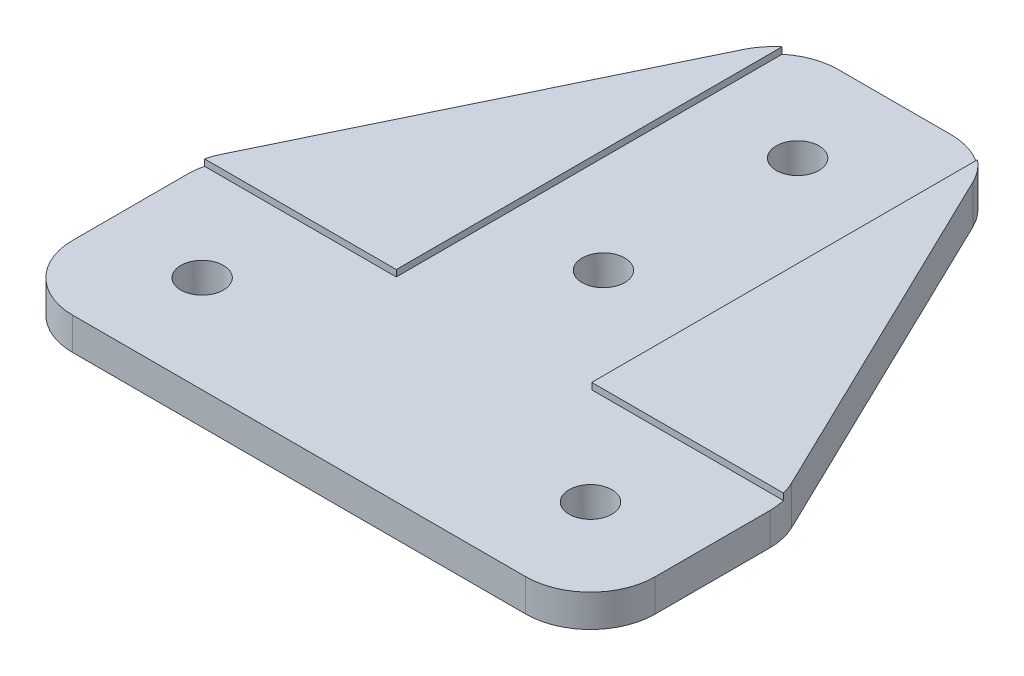
ISO-10303-21;
HEADER;
FILE_DESCRIPTION(('STEP AP214'),'2;1');
FILE_NAME('part.step','',(''),(''),'','','');
FILE_SCHEMA(('AUTOMOTIVE_DESIGN { 1 0 10303 214 1 1 1 1 }'));
ENDSEC;
DATA;
#1=APPLICATION_CONTEXT('core data for automotive mechanical design processes');
#2=APPLICATION_PROTOCOL_DEFINITION('international standard','automotive_design',2000,#1);
#3=PRODUCT_CONTEXT('',#1,'mechanical');
#4=PRODUCT('Part','Part','',(#3));
#5=PRODUCT_RELATED_PRODUCT_CATEGORY('part','',(#4));
#6=PRODUCT_DEFINITION_FORMATION('','',#4);
#7=PRODUCT_DEFINITION_CONTEXT('part definition',#1,'design');
#8=PRODUCT_DEFINITION('design','',#6,#7);
#9=PRODUCT_DEFINITION_SHAPE('','',#8);
#10=(LENGTH_UNIT() NAMED_UNIT(*) SI_UNIT(.MILLI.,.METRE.));
#11=(NAMED_UNIT(*) PLANE_ANGLE_UNIT() SI_UNIT($,.RADIAN.));
#12=(NAMED_UNIT(*) SI_UNIT($,.STERADIAN.) SOLID_ANGLE_UNIT());
#13=UNCERTAINTY_MEASURE_WITH_UNIT(LENGTH_MEASURE(1.E-05),#10,'distance_accuracy_value','');
#14=(GEOMETRIC_REPRESENTATION_CONTEXT(3) GLOBAL_UNCERTAINTY_ASSIGNED_CONTEXT((#13)) GLOBAL_UNIT_ASSIGNED_CONTEXT((#10,
#11,#12)) REPRESENTATION_CONTEXT('',''));
#15=CARTESIAN_POINT('',(0.,0.,0.));
#16=DIRECTION('',(0.,0.,1.));
#17=DIRECTION('',(1.,0.,0.));
#18=AXIS2_PLACEMENT_3D('',#15,#16,#17);
#19=CARTESIAN_POINT('',(0.,3.,0.));
#20=DIRECTION('',(0.,1.,0.));
#21=DIRECTION('',(0.,0.,1.));
#22=AXIS2_PLACEMENT_3D('',#19,#20,#21);
#23=PLANE('',#22);
#24=DIRECTION('',(-1.,0.,0.));
#25=VECTOR('',#24,1.);
#26=CARTESIAN_POINT('',(0.,3.,-15.05));
#27=LINE('',#26,#25);
#28=CARTESIAN_POINT('',(14.95,3.,-15.05));
#29=VERTEX_POINT('',#28);
#30=CARTESIAN_POINT('',(0.145177207228024,3.,-15.05));
#31=VERTEX_POINT('',#30);
#32=EDGE_CURVE('E221',#29,#31,#27,.T.);
#33=ORIENTED_EDGE('',*,*,#32,.F.);
#34=DIRECTION('',(0.,0.,1.));
#35=VECTOR('',#34,1.);
#36=CARTESIAN_POINT('',(14.95,3.,-46.));
#37=LINE('',#36,#35);
#38=CARTESIAN_POINT('',(14.95,3.,-44.8541389701653));
#39=VERTEX_POINT('',#38);
#40=EDGE_CURVE('E218',#39,#29,#37,.T.);
#41=ORIENTED_EDGE('',*,*,#40,.F.);
#42=CARTESIAN_POINT('',(18.1352178573299,3.,-41.));
#43=DIRECTION('',(0.,1.,0.));
#44=DIRECTION('',(0.,0.,1.));
#45=AXIS2_PLACEMENT_3D('',#42,#43,#44);
#46=CIRCLE('',#45,5.);
#47=CARTESIAN_POINT('',(13.6344216002523,3.,-43.1778046405214));
#48=VERTEX_POINT('',#47);
#49=EDGE_CURVE('E341',#39,#48,#46,.T.);
#50=ORIENTED_EDGE('',*,*,#49,.T.);
#51=DIRECTION('',(-0.435560928104281,0.,0.900159251415514));
#52=VECTOR('',#51,1.);
#53=CARTESIAN_POINT('',(15.,3.,-46.));
#54=LINE('',#53,#52);
#55=CARTESIAN_POINT('',(0.499203742922432,3.,-16.031687735373));
#56=VERTEX_POINT('',#55);
#57=EDGE_CURVE('E278',#48,#56,#54,.T.);
#58=ORIENTED_EDGE('',*,*,#57,.T.);
#59=CARTESIAN_POINT('',(5.,3.,-13.8538830948516));
#60=DIRECTION('',(0.,1.,0.));
#61=DIRECTION('',(0.,0.,1.));
#62=AXIS2_PLACEMENT_3D('',#59,#60,#61);
#63=CIRCLE('',#62,5.);
#64=EDGE_CURVE('E334',#56,#31,#63,.T.);
#65=ORIENTED_EDGE('',*,*,#64,.T.);
#66=EDGE_LOOP('',(#33,#41,#50,#58,#65));
#67=FACE_BOUND('',#66,.T.);
#68=ADVANCED_FACE('F46',(#67),#23,.T.);
#69=CARTESIAN_POINT('',(0.,3.,-15.));
#70=DIRECTION('',(1.,0.,0.));
#71=DIRECTION('',(0.,0.,-1.));
#72=AXIS2_PLACEMENT_3D('',#69,#70,#71);
#73=PLANE('',#72);
#74=DIRECTION('',(0.,-1.,0.));
#75=VECTOR('',#74,1.);
#76=CARTESIAN_POINT('',(0.,3.,-5.));
#77=LINE('',#76,#75);
#78=CARTESIAN_POINT('',(0.,0.,-5.));
#79=VERTEX_POINT('',#78);
#80=CARTESIAN_POINT('',(0.,2.5,-5.));
#81=VERTEX_POINT('',#80);
#82=EDGE_CURVE('E368',#79,#81,#77,.F.);
#83=ORIENTED_EDGE('',*,*,#82,.T.);
#84=DIRECTION('',(0.,0.,1.));
#85=VECTOR('',#84,1.);
#86=CARTESIAN_POINT('',(0.,2.5,0.));
#87=LINE('',#86,#85);
#88=CARTESIAN_POINT('',(0.,2.5,-13.8538830948516));
#89=VERTEX_POINT('',#88);
#90=EDGE_CURVE('E62',#89,#81,#87,.T.);
#91=ORIENTED_EDGE('',*,*,#90,.F.);
#92=DIRECTION('',(0.,-1.,0.));
#93=VECTOR('',#92,1.);
#94=CARTESIAN_POINT('',(0.,3.,-13.8538830948516));
#95=LINE('',#94,#93);
#96=CARTESIAN_POINT('',(0.,0.,-13.8538830948516));
#97=VERTEX_POINT('',#96);
#98=EDGE_CURVE('E372',#89,#97,#95,.T.);
#99=ORIENTED_EDGE('',*,*,#98,.T.);
#100=DIRECTION('',(0.,0.,1.));
#101=VECTOR('',#100,1.);
#102=CARTESIAN_POINT('',(0.,0.,-15.));
#103=LINE('',#102,#101);
#104=EDGE_CURVE('E262',#97,#79,#103,.T.);
#105=ORIENTED_EDGE('',*,*,#104,.T.);
#106=EDGE_LOOP('',(#83,#91,#99,#105));
#107=FACE_BOUND('',#106,.T.);
#108=ADVANCED_FACE('F454',(#107),#73,.F.);
#109=CARTESIAN_POINT('',(0.,3.,0.));
#110=DIRECTION('',(0.,0.,-1.));
#111=DIRECTION('',(-1.,0.,0.));
#112=AXIS2_PLACEMENT_3D('',#109,#110,#111);
#113=PLANE('',#112);
#114=DIRECTION('',(0.,-1.,0.));
#115=VECTOR('',#114,1.);
#116=CARTESIAN_POINT('',(40.,3.,0.));
#117=LINE('',#116,#115);
#118=CARTESIAN_POINT('',(40.,0.,0.));
#119=VERTEX_POINT('',#118);
#120=CARTESIAN_POINT('',(40.,2.5,0.));
#121=VERTEX_POINT('',#120);
#122=EDGE_CURVE('E364',#119,#121,#117,.F.);
#123=ORIENTED_EDGE('',*,*,#122,.T.);
#124=DIRECTION('',(1.,0.,0.));
#125=VECTOR('',#124,1.);
#126=CARTESIAN_POINT('',(0.,2.5,0.));
#127=LINE('',#126,#125);
#128=CARTESIAN_POINT('',(5.,2.5,0.));
#129=VERTEX_POINT('',#128);
#130=EDGE_CURVE('E450',#129,#121,#127,.T.);
#131=ORIENTED_EDGE('',*,*,#130,.F.);
#132=DIRECTION('',(0.,-1.,0.));
#133=VECTOR('',#132,1.);
#134=CARTESIAN_POINT('',(5.,3.,0.));
#135=LINE('',#134,#133);
#136=CARTESIAN_POINT('',(5.,0.,0.));
#137=VERTEX_POINT('',#136);
#138=EDGE_CURVE('E361',#129,#137,#135,.T.);
#139=ORIENTED_EDGE('',*,*,#138,.T.);
#140=DIRECTION('',(1.,0.,0.));
#141=VECTOR('',#140,1.);
#142=CARTESIAN_POINT('',(0.,0.,0.));
#143=LINE('',#142,#141);
#144=EDGE_CURVE('E286',#137,#119,#143,.T.);
#145=ORIENTED_EDGE('',*,*,#144,.T.);
#146=EDGE_LOOP('',(#123,#131,#139,#145));
#147=FACE_BOUND('',#146,.T.);
#148=ADVANCED_FACE('F446',(#147),#113,.F.);
#149=CARTESIAN_POINT('',(45.,3.,0.));
#150=DIRECTION('',(-1.,0.,0.));
#151=DIRECTION('',(0.,0.,1.));
#152=AXIS2_PLACEMENT_3D('',#149,#150,#151);
#153=PLANE('',#152);
#154=DIRECTION('',(0.,-1.,0.));
#155=VECTOR('',#154,1.);
#156=CARTESIAN_POINT('',(45.,3.,-13.8538830948516));
#157=LINE('',#156,#155);
#158=CARTESIAN_POINT('',(45.,0.,-13.8538830948516));
#159=VERTEX_POINT('',#158);
#160=CARTESIAN_POINT('',(45.,2.5,-13.8538830948516));
#161=VERTEX_POINT('',#160);
#162=EDGE_CURVE('E357',#159,#161,#157,.F.);
#163=ORIENTED_EDGE('',*,*,#162,.T.);
#164=DIRECTION('',(0.,0.,-1.));
#165=VECTOR('',#164,1.);
#166=CARTESIAN_POINT('',(45.,2.5,0.));
#167=LINE('',#166,#165);
#168=CARTESIAN_POINT('',(45.,2.5,-5.));
#169=VERTEX_POINT('',#168);
#170=EDGE_CURVE('E184',#169,#161,#167,.T.);
#171=ORIENTED_EDGE('',*,*,#170,.F.);
#172=DIRECTION('',(0.,-1.,0.));
#173=VECTOR('',#172,1.);
#174=CARTESIAN_POINT('',(45.,3.,-5.));
#175=LINE('',#174,#173);
#176=CARTESIAN_POINT('',(45.,0.,-5.));
#177=VERTEX_POINT('',#176);
#178=EDGE_CURVE('E354',#169,#177,#175,.T.);
#179=ORIENTED_EDGE('',*,*,#178,.T.);
#180=DIRECTION('',(0.,0.,-1.));
#181=VECTOR('',#180,1.);
#182=CARTESIAN_POINT('',(45.,0.,0.));
#183=LINE('',#182,#181);
#184=EDGE_CURVE('E290',#177,#159,#183,.T.);
#185=ORIENTED_EDGE('',*,*,#184,.T.);
#186=EDGE_LOOP('',(#163,#171,#179,#185));
#187=FACE_BOUND('',#186,.T.);
#188=ADVANCED_FACE('F436',(#187),#153,.F.);
#189=CARTESIAN_POINT('',(45.,3.,-15.));
#190=DIRECTION('',(-0.900159251415513,0.,0.435560928104281));
#191=DIRECTION('',(0.435560928104281,0.,0.900159251415513));
#192=AXIS2_PLACEMENT_3D('',#189,#190,#191);
#193=PLANE('',#192);
#194=DIRECTION('',(-0.435560928104281,0.,-0.900159251415514));
#195=VECTOR('',#194,1.);
#196=CARTESIAN_POINT('',(45.,0.,-15.));
#197=LINE('',#196,#195);
#198=CARTESIAN_POINT('',(44.5007962570776,0.,-16.031687735373));
#199=VERTEX_POINT('',#198);
#200=CARTESIAN_POINT('',(31.3655783997477,0.,-43.1778046405214));
#201=VERTEX_POINT('',#200);
#202=EDGE_CURVE('E294',#199,#201,#197,.T.);
#203=ORIENTED_EDGE('',*,*,#202,.T.);
#204=DIRECTION('',(0.,-1.,0.));
#205=VECTOR('',#204,1.);
#206=CARTESIAN_POINT('',(31.3655783997477,3.,-43.1778046405214));
#207=LINE('',#206,#205);
#208=CARTESIAN_POINT('',(31.3655783997477,3.,-43.1778046405214));
#209=VERTEX_POINT('',#208);
#210=EDGE_CURVE('E331',#201,#209,#207,.F.);
#211=ORIENTED_EDGE('',*,*,#210,.T.);
#212=DIRECTION('',(-0.435560928104281,0.,-0.900159251415514));
#213=VECTOR('',#212,1.);
#214=CARTESIAN_POINT('',(45.,3.,-15.));
#215=LINE('',#214,#213);
#216=CARTESIAN_POINT('',(44.5007962570776,3.,-16.031687735373));
#217=VERTEX_POINT('',#216);
#218=EDGE_CURVE('E274',#217,#209,#215,.T.);
#219=ORIENTED_EDGE('',*,*,#218,.F.);
#220=DIRECTION('',(0.,-1.,0.));
#221=VECTOR('',#220,1.);
#222=CARTESIAN_POINT('',(44.5007962570776,3.,-16.031687735373));
#223=LINE('',#222,#221);
#224=EDGE_CURVE('E327',#217,#199,#223,.T.);
#225=ORIENTED_EDGE('',*,*,#224,.T.);
#226=EDGE_LOOP('',(#203,#211,#219,#225));
#227=FACE_BOUND('',#226,.T.);
#228=ADVANCED_FACE('F423',(#227),#193,.F.);
#229=CARTESIAN_POINT('',(30.,3.,-46.));
#230=DIRECTION('',(0.,0.,1.));
#231=DIRECTION('',(1.,0.,0.));
#232=AXIS2_PLACEMENT_3D('',#229,#230,#231);
#233=PLANE('',#232);
#234=DIRECTION('',(0.,-1.,0.));
#235=VECTOR('',#234,1.);
#236=CARTESIAN_POINT('',(18.1352178573299,3.,-46.));
#237=LINE('',#236,#235);
#238=CARTESIAN_POINT('',(18.1352178573299,0.,-46.));
#239=VERTEX_POINT('',#238);
#240=CARTESIAN_POINT('',(18.1352178573299,2.5,-46.));
#241=VERTEX_POINT('',#240);
#242=EDGE_CURVE('E282',#239,#241,#237,.F.);
#243=ORIENTED_EDGE('',*,*,#242,.T.);
#244=DIRECTION('',(-1.,0.,0.));
#245=VECTOR('',#244,1.);
#246=CARTESIAN_POINT('',(14.95,2.5,-46.));
#247=LINE('',#246,#245);
#248=CARTESIAN_POINT('',(26.8647821426701,2.5,-46.));
#249=VERTEX_POINT('',#248);
#250=EDGE_CURVE('E200',#249,#241,#247,.T.);
#251=ORIENTED_EDGE('',*,*,#250,.F.);
#252=DIRECTION('',(0.,-1.,0.));
#253=VECTOR('',#252,1.);
#254=CARTESIAN_POINT('',(26.8647821426701,3.,-46.));
#255=LINE('',#254,#253);
#256=CARTESIAN_POINT('',(26.8647821426701,0.,-46.));
#257=VERTEX_POINT('',#256);
#258=EDGE_CURVE('E306',#249,#257,#255,.T.);
#259=ORIENTED_EDGE('',*,*,#258,.T.);
#260=DIRECTION('',(-1.,0.,0.));
#261=VECTOR('',#260,1.);
#262=CARTESIAN_POINT('',(30.,0.,-46.));
#263=LINE('',#262,#261);
#264=EDGE_CURVE('E298',#257,#239,#263,.T.);
#265=ORIENTED_EDGE('',*,*,#264,.T.);
#266=EDGE_LOOP('',(#243,#251,#259,#265));
#267=FACE_BOUND('',#266,.T.);
#268=ADVANCED_FACE('F416',(#267),#233,.F.);
#269=CARTESIAN_POINT('',(15.,3.,-46.));
#270=DIRECTION('',(0.900159251415513,0.,0.43556092810428));
#271=DIRECTION('',(0.435560928104281,0.,-0.900159251415514));
#272=AXIS2_PLACEMENT_3D('',#269,#270,#271);
#273=PLANE('',#272);
#274=ORIENTED_EDGE('',*,*,#57,.F.);
#275=DIRECTION('',(0.,-1.,0.));
#276=VECTOR('',#275,1.);
#277=CARTESIAN_POINT('',(13.6344216002523,3.,-43.1778046405214));
#278=LINE('',#277,#276);
#279=CARTESIAN_POINT('',(13.6344216002523,0.,-43.1778046405214));
#280=VERTEX_POINT('',#279);
#281=EDGE_CURVE('E350',#48,#280,#278,.T.);
#282=ORIENTED_EDGE('',*,*,#281,.T.);
#283=DIRECTION('',(-0.435560928104281,0.,0.900159251415514));
#284=VECTOR('',#283,1.);
#285=CARTESIAN_POINT('',(15.,0.,-46.));
#286=LINE('',#285,#284);
#287=CARTESIAN_POINT('',(0.499203742922432,0.,-16.031687735373));
#288=VERTEX_POINT('',#287);
#289=EDGE_CURVE('E279',#280,#288,#286,.T.);
#290=ORIENTED_EDGE('',*,*,#289,.T.);
#291=DIRECTION('',(0.,-1.,0.));
#292=VECTOR('',#291,1.);
#293=CARTESIAN_POINT('',(0.49920374292243,3.,-16.031687735373));
#294=LINE('',#293,#292);
#295=EDGE_CURVE('E70',#288,#56,#294,.F.);
#296=ORIENTED_EDGE('',*,*,#295,.T.);
#297=EDGE_LOOP('',(#274,#282,#290,#296));
#298=FACE_BOUND('',#297,.T.);
#299=ADVANCED_FACE('F399',(#298),#273,.F.);
#300=DIRECTION('',(0.,0.,-1.));
#301=VECTOR('',#300,1.);
#302=CARTESIAN_POINT('',(30.05,3.,-46.));
#303=LINE('',#302,#301);
#304=CARTESIAN_POINT('',(30.05,3.,-15.05));
#305=VERTEX_POINT('',#304);
#306=CARTESIAN_POINT('',(30.05,3.,-44.8541389701653));
#307=VERTEX_POINT('',#306);
#308=EDGE_CURVE('E215',#305,#307,#303,.T.);
#309=ORIENTED_EDGE('',*,*,#308,.F.);
#310=DIRECTION('',(-1.,0.,0.));
#311=VECTOR('',#310,1.);
#312=CARTESIAN_POINT('',(30.05,3.,-15.05));
#313=LINE('',#312,#311);
#314=CARTESIAN_POINT('',(44.854822792772,3.,-15.05));
#315=VERTEX_POINT('',#314);
#316=EDGE_CURVE('E190',#315,#305,#313,.T.);
#317=ORIENTED_EDGE('',*,*,#316,.F.);
#318=CARTESIAN_POINT('',(40.,3.,-13.8538830948516));
#319=DIRECTION('',(0.,1.,0.));
#320=DIRECTION('',(0.,0.,1.));
#321=AXIS2_PLACEMENT_3D('',#318,#319,#320);
#322=CIRCLE('',#321,5.);
#323=EDGE_CURVE('E338',#315,#217,#322,.T.);
#324=ORIENTED_EDGE('',*,*,#323,.T.);
#325=ORIENTED_EDGE('',*,*,#218,.T.);
#326=CARTESIAN_POINT('',(26.8647821426701,3.,-41.));
#327=DIRECTION('',(0.,1.,0.));
#328=DIRECTION('',(0.,0.,1.));
#329=AXIS2_PLACEMENT_3D('',#326,#327,#328);
#330=CIRCLE('',#329,5.);
#331=EDGE_CURVE('E344',#209,#307,#330,.T.);
#332=ORIENTED_EDGE('',*,*,#331,.T.);
#333=EDGE_LOOP('',(#309,#317,#324,#325,#332));
#334=FACE_BOUND('',#333,.T.);
#335=ADVANCED_FACE('F429',(#334),#23,.T.);
#336=CARTESIAN_POINT('',(0.,0.,0.));
#337=DIRECTION('',(0.,1.,0.));
#338=DIRECTION('',(0.,0.,1.));
#339=AXIS2_PLACEMENT_3D('',#336,#337,#338);
#340=PLANE('',#339);
#341=CARTESIAN_POINT('',(7.5,0.,-7.5));
#342=DIRECTION('',(0.,1.,0.));
#343=DIRECTION('',(0.,0.,1.));
#344=AXIS2_PLACEMENT_3D('',#341,#342,#343);
#345=CIRCLE('',#344,1.65);
#346=CARTESIAN_POINT('',(7.5,0.,-5.85));
#347=VERTEX_POINT('',#346);
#348=EDGE_CURVE('E258',#347,#347,#345,.T.);
#349=ORIENTED_EDGE('',*,*,#348,.T.);
#350=EDGE_LOOP('',(#349));
#351=FACE_BOUND('',#350,.T.);
#352=CARTESIAN_POINT('',(22.5,0.,-38.5));
#353=DIRECTION('',(0.,1.,0.));
#354=DIRECTION('',(0.,0.,1.));
#355=AXIS2_PLACEMENT_3D('',#352,#353,#354);
#356=CIRCLE('',#355,1.65);
#357=CARTESIAN_POINT('',(22.5,0.,-36.85));
#358=VERTEX_POINT('',#357);
#359=EDGE_CURVE('E263',#358,#358,#356,.T.);
#360=ORIENTED_EDGE('',*,*,#359,.T.);
#361=EDGE_LOOP('',(#360));
#362=FACE_BOUND('',#361,.T.);
#363=CARTESIAN_POINT('',(22.5,0.,-23.5));
#364=DIRECTION('',(0.,1.,0.));
#365=DIRECTION('',(0.,0.,1.));
#366=AXIS2_PLACEMENT_3D('',#363,#364,#365);
#367=CIRCLE('',#366,1.65);
#368=CARTESIAN_POINT('',(22.5,0.,-21.85));
#369=VERTEX_POINT('',#368);
#370=EDGE_CURVE('E267',#369,#369,#367,.T.);
#371=ORIENTED_EDGE('',*,*,#370,.T.);
#372=EDGE_LOOP('',(#371));
#373=FACE_BOUND('',#372,.T.);
#374=CARTESIAN_POINT('',(37.5,0.,-7.5));
#375=DIRECTION('',(0.,1.,0.));
#376=DIRECTION('',(0.,0.,1.));
#377=AXIS2_PLACEMENT_3D('',#374,#375,#376);
#378=CIRCLE('',#377,1.65);
#379=CARTESIAN_POINT('',(37.5,0.,-5.85));
#380=VERTEX_POINT('',#379);
#381=EDGE_CURVE('E257',#380,#380,#378,.T.);
#382=ORIENTED_EDGE('',*,*,#381,.T.);
#383=EDGE_LOOP('',(#382));
#384=FACE_BOUND('',#383,.T.);
#385=ORIENTED_EDGE('',*,*,#264,.F.);
#386=CARTESIAN_POINT('',(26.8647821426701,0.,-41.));
#387=DIRECTION('',(0.,1.,0.));
#388=DIRECTION('',(0.,0.,1.));
#389=AXIS2_PLACEMENT_3D('',#386,#387,#388);
#390=CIRCLE('',#389,5.);
#391=EDGE_CURVE('E324',#257,#201,#390,.F.);
#392=ORIENTED_EDGE('',*,*,#391,.T.);
#393=ORIENTED_EDGE('',*,*,#202,.F.);
#394=CARTESIAN_POINT('',(40.,0.,-13.8538830948516));
#395=DIRECTION('',(0.,1.,0.));
#396=DIRECTION('',(0.,0.,1.));
#397=AXIS2_PLACEMENT_3D('',#394,#395,#396);
#398=CIRCLE('',#397,5.);
#399=EDGE_CURVE('E318',#199,#159,#398,.F.);
#400=ORIENTED_EDGE('',*,*,#399,.T.);
#401=ORIENTED_EDGE('',*,*,#184,.F.);
#402=CARTESIAN_POINT('',(40.,0.,-5.));
#403=DIRECTION('',(0.,1.,0.));
#404=DIRECTION('',(0.,0.,1.));
#405=AXIS2_PLACEMENT_3D('',#402,#403,#404);
#406=CIRCLE('',#405,5.);
#407=EDGE_CURVE('E315',#177,#119,#406,.F.);
#408=ORIENTED_EDGE('',*,*,#407,.T.);
#409=ORIENTED_EDGE('',*,*,#144,.F.);
#410=CARTESIAN_POINT('',(5.,0.,-5.));
#411=DIRECTION('',(0.,1.,0.));
#412=DIRECTION('',(0.,0.,1.));
#413=AXIS2_PLACEMENT_3D('',#410,#411,#412);
#414=CIRCLE('',#413,5.);
#415=EDGE_CURVE('E309',#137,#79,#414,.F.);
#416=ORIENTED_EDGE('',*,*,#415,.T.);
#417=ORIENTED_EDGE('',*,*,#104,.F.);
#418=CARTESIAN_POINT('',(5.,0.,-13.8538830948516));
#419=DIRECTION('',(0.,1.,0.));
#420=DIRECTION('',(0.,0.,1.));
#421=AXIS2_PLACEMENT_3D('',#418,#419,#420);
#422=CIRCLE('',#421,5.);
#423=EDGE_CURVE('E312',#97,#288,#422,.F.);
#424=ORIENTED_EDGE('',*,*,#423,.T.);
#425=ORIENTED_EDGE('',*,*,#289,.F.);
#426=CARTESIAN_POINT('',(18.1352178573299,0.,-41.));
#427=DIRECTION('',(0.,1.,0.));
#428=DIRECTION('',(0.,0.,1.));
#429=AXIS2_PLACEMENT_3D('',#426,#427,#428);
#430=CIRCLE('',#429,5.);
#431=EDGE_CURVE('E321',#280,#239,#430,.F.);
#432=ORIENTED_EDGE('',*,*,#431,.T.);
#433=EDGE_LOOP('',(#385,#392,#393,#400,#401,#408,#409,#416,#417,#424,#425,#432));
#434=FACE_BOUND('',#433,.T.);
#435=ADVANCED_FACE('F402',(#351,#362,#373,#384,#434),#340,.F.);
#436=CARTESIAN_POINT('',(37.5,0.,-7.5));
#437=DIRECTION('',(0.,1.,0.));
#438=DIRECTION('',(0.,0.,1.));
#439=AXIS2_PLACEMENT_3D('',#436,#437,#438);
#440=CYLINDRICAL_SURFACE('',#439,1.65);
#441=CARTESIAN_POINT('',(37.5,2.5,-7.5));
#442=DIRECTION('',(0.,-1.,0.));
#443=DIRECTION('',(0.,0.,-1.));
#444=AXIS2_PLACEMENT_3D('',#441,#442,#443);
#445=CIRCLE('',#444,1.65);
#446=CARTESIAN_POINT('',(37.5,2.5,-9.15));
#447=VERTEX_POINT('',#446);
#448=EDGE_CURVE('E253',#447,#447,#445,.F.);
#449=ORIENTED_EDGE('',*,*,#448,.T.);
#450=EDGE_LOOP('',(#449));
#451=FACE_BOUND('',#450,.T.);
#452=ORIENTED_EDGE('',*,*,#381,.F.);
#453=EDGE_LOOP('',(#452));
#454=FACE_BOUND('',#453,.T.);
#455=ADVANCED_FACE('F506',(#451,#454),#440,.F.);
#456=CARTESIAN_POINT('',(22.5,0.,-23.5));
#457=DIRECTION('',(0.,1.,0.));
#458=DIRECTION('',(0.,0.,1.));
#459=AXIS2_PLACEMENT_3D('',#456,#457,#458);
#460=CYLINDRICAL_SURFACE('',#459,1.65);
#461=CARTESIAN_POINT('',(22.5,2.5,-23.5));
#462=DIRECTION('',(0.,-1.,0.));
#463=DIRECTION('',(0.,0.,-1.));
#464=AXIS2_PLACEMENT_3D('',#461,#462,#463);
#465=CIRCLE('',#464,1.65);
#466=CARTESIAN_POINT('',(22.5,2.5,-25.15));
#467=VERTEX_POINT('',#466);
#468=EDGE_CURVE('E249',#467,#467,#465,.F.);
#469=ORIENTED_EDGE('',*,*,#468,.T.);
#470=EDGE_LOOP('',(#469));
#471=FACE_BOUND('',#470,.T.);
#472=ORIENTED_EDGE('',*,*,#370,.F.);
#473=EDGE_LOOP('',(#472));
#474=FACE_BOUND('',#473,.T.);
#475=ADVANCED_FACE('F502',(#471,#474),#460,.F.);
#476=CARTESIAN_POINT('',(22.5,0.,-38.5));
#477=DIRECTION('',(0.,1.,0.));
#478=DIRECTION('',(0.,0.,1.));
#479=AXIS2_PLACEMENT_3D('',#476,#477,#478);
#480=CYLINDRICAL_SURFACE('',#479,1.65);
#481=CARTESIAN_POINT('',(22.5,2.5,-38.5));
#482=DIRECTION('',(0.,-1.,0.));
#483=DIRECTION('',(0.,0.,-1.));
#484=AXIS2_PLACEMENT_3D('',#481,#482,#483);
#485=CIRCLE('',#484,1.65);
#486=CARTESIAN_POINT('',(22.5,2.5,-40.15));
#487=VERTEX_POINT('',#486);
#488=EDGE_CURVE('E245',#487,#487,#485,.F.);
#489=ORIENTED_EDGE('',*,*,#488,.T.);
#490=EDGE_LOOP('',(#489));
#491=FACE_BOUND('',#490,.T.);
#492=ORIENTED_EDGE('',*,*,#359,.F.);
#493=EDGE_LOOP('',(#492));
#494=FACE_BOUND('',#493,.T.);
#495=ADVANCED_FACE('F498',(#491,#494),#480,.F.);
#496=CARTESIAN_POINT('',(7.5,0.,-7.5));
#497=DIRECTION('',(0.,1.,0.));
#498=DIRECTION('',(0.,0.,1.));
#499=AXIS2_PLACEMENT_3D('',#496,#497,#498);
#500=CYLINDRICAL_SURFACE('',#499,1.65);
#501=CARTESIAN_POINT('',(7.5,2.5,-7.5));
#502=DIRECTION('',(0.,-1.,0.));
#503=DIRECTION('',(0.,0.,-1.));
#504=AXIS2_PLACEMENT_3D('',#501,#502,#503);
#505=CIRCLE('',#504,1.65);
#506=CARTESIAN_POINT('',(7.5,2.5,-9.15));
#507=VERTEX_POINT('',#506);
#508=EDGE_CURVE('E241',#507,#507,#505,.F.);
#509=ORIENTED_EDGE('',*,*,#508,.T.);
#510=EDGE_LOOP('',(#509));
#511=FACE_BOUND('',#510,.T.);
#512=ORIENTED_EDGE('',*,*,#348,.F.);
#513=EDGE_LOOP('',(#512));
#514=FACE_BOUND('',#513,.T.);
#515=ADVANCED_FACE('F471',(#511,#514),#500,.F.);
#516=CARTESIAN_POINT('',(26.8647821426701,3.,-41.));
#517=DIRECTION('',(0.,-1.,0.));
#518=DIRECTION('',(0.,0.,-1.));
#519=AXIS2_PLACEMENT_3D('',#516,#517,#518);
#520=CYLINDRICAL_SURFACE('',#519,5.);
#521=DIRECTION('',(0.,-1.,0.));
#522=VECTOR('',#521,1.);
#523=CARTESIAN_POINT('',(30.05,3.,-44.8541389701653));
#524=LINE('',#523,#522);
#525=CARTESIAN_POINT('',(30.05,2.5,-44.8541389701653));
#526=VERTEX_POINT('',#525);
#527=EDGE_CURVE('E12',#307,#526,#524,.T.);
#528=ORIENTED_EDGE('',*,*,#527,.F.);
#529=ORIENTED_EDGE('',*,*,#331,.F.);
#530=ORIENTED_EDGE('',*,*,#210,.F.);
#531=ORIENTED_EDGE('',*,*,#391,.F.);
#532=ORIENTED_EDGE('',*,*,#258,.F.);
#533=CARTESIAN_POINT('',(26.8647821426701,2.5,-41.));
#534=DIRECTION('',(0.,-1.,0.));
#535=DIRECTION('',(0.,0.,-1.));
#536=AXIS2_PLACEMENT_3D('',#533,#534,#535);
#537=CIRCLE('',#536,5.);
#538=EDGE_CURVE('E238',#526,#249,#537,.F.);
#539=ORIENTED_EDGE('',*,*,#538,.F.);
#540=EDGE_LOOP('',(#528,#529,#530,#531,#532,#539));
#541=FACE_BOUND('',#540,.T.);
#542=ADVANCED_FACE('F427',(#541),#520,.T.);
#543=CARTESIAN_POINT('',(18.1352178573299,3.,-41.));
#544=DIRECTION('',(0.,-1.,0.));
#545=DIRECTION('',(0.,0.,-1.));
#546=AXIS2_PLACEMENT_3D('',#543,#544,#545);
#547=CYLINDRICAL_SURFACE('',#546,5.);
#548=DIRECTION('',(0.,-1.,0.));
#549=VECTOR('',#548,1.);
#550=CARTESIAN_POINT('',(14.95,3.,-44.8541389701653));
#551=LINE('',#550,#549);
#552=CARTESIAN_POINT('',(14.95,2.5,-44.8541389701653));
#553=VERTEX_POINT('',#552);
#554=EDGE_CURVE('E55',#553,#39,#551,.F.);
#555=ORIENTED_EDGE('',*,*,#554,.F.);
#556=CARTESIAN_POINT('',(18.1352178573299,2.5,-41.));
#557=DIRECTION('',(0.,-1.,0.));
#558=DIRECTION('',(0.,0.,-1.));
#559=AXIS2_PLACEMENT_3D('',#556,#557,#558);
#560=CIRCLE('',#559,5.);
#561=EDGE_CURVE('E235',#241,#553,#560,.F.);
#562=ORIENTED_EDGE('',*,*,#561,.F.);
#563=ORIENTED_EDGE('',*,*,#242,.F.);
#564=ORIENTED_EDGE('',*,*,#431,.F.);
#565=ORIENTED_EDGE('',*,*,#281,.F.);
#566=ORIENTED_EDGE('',*,*,#49,.F.);
#567=EDGE_LOOP('',(#555,#562,#563,#564,#565,#566));
#568=FACE_BOUND('',#567,.T.);
#569=ADVANCED_FACE('F396',(#568),#547,.T.);
#570=CARTESIAN_POINT('',(40.,3.,-13.8538830948516));
#571=DIRECTION('',(0.,-1.,0.));
#572=DIRECTION('',(0.,0.,-1.));
#573=AXIS2_PLACEMENT_3D('',#570,#571,#572);
#574=CYLINDRICAL_SURFACE('',#573,5.);
#575=DIRECTION('',(0.,-1.,0.));
#576=VECTOR('',#575,1.);
#577=CARTESIAN_POINT('',(44.854822792772,3.,-15.05));
#578=LINE('',#577,#576);
#579=CARTESIAN_POINT('',(44.854822792772,2.5,-15.05));
#580=VERTEX_POINT('',#579);
#581=EDGE_CURVE('E381',#580,#315,#578,.F.);
#582=ORIENTED_EDGE('',*,*,#581,.F.);
#583=CARTESIAN_POINT('',(40.,2.5,-13.8538830948516));
#584=DIRECTION('',(0.,-1.,0.));
#585=DIRECTION('',(0.,0.,-1.));
#586=AXIS2_PLACEMENT_3D('',#583,#584,#585);
#587=CIRCLE('',#586,5.);
#588=EDGE_CURVE('E180',#161,#580,#587,.F.);
#589=ORIENTED_EDGE('',*,*,#588,.F.);
#590=ORIENTED_EDGE('',*,*,#162,.F.);
#591=ORIENTED_EDGE('',*,*,#399,.F.);
#592=ORIENTED_EDGE('',*,*,#224,.F.);
#593=ORIENTED_EDGE('',*,*,#323,.F.);
#594=EDGE_LOOP('',(#582,#589,#590,#591,#592,#593));
#595=FACE_BOUND('',#594,.T.);
#596=ADVANCED_FACE('F432',(#595),#574,.T.);
#597=CARTESIAN_POINT('',(40.,3.,-5.));
#598=DIRECTION('',(0.,-1.,0.));
#599=DIRECTION('',(0.,0.,-1.));
#600=AXIS2_PLACEMENT_3D('',#597,#598,#599);
#601=CYLINDRICAL_SURFACE('',#600,5.);
#602=CARTESIAN_POINT('',(40.,2.5,-5.));
#603=DIRECTION('',(0.,-1.,0.));
#604=DIRECTION('',(0.,0.,-1.));
#605=AXIS2_PLACEMENT_3D('',#602,#603,#604);
#606=CIRCLE('',#605,5.);
#607=EDGE_CURVE('E230',#121,#169,#606,.F.);
#608=ORIENTED_EDGE('',*,*,#607,.F.);
#609=ORIENTED_EDGE('',*,*,#122,.F.);
#610=ORIENTED_EDGE('',*,*,#407,.F.);
#611=ORIENTED_EDGE('',*,*,#178,.F.);
#612=EDGE_LOOP('',(#608,#609,#610,#611));
#613=FACE_BOUND('',#612,.T.);
#614=ADVANCED_FACE('F443',(#613),#601,.T.);
#615=CARTESIAN_POINT('',(5.,3.,-13.8538830948516));
#616=DIRECTION('',(0.,-1.,0.));
#617=DIRECTION('',(0.,0.,-1.));
#618=AXIS2_PLACEMENT_3D('',#615,#616,#617);
#619=CYLINDRICAL_SURFACE('',#618,5.);
#620=DIRECTION('',(0.,-1.,0.));
#621=VECTOR('',#620,1.);
#622=CARTESIAN_POINT('',(0.145177207228024,3.,-15.05));
#623=LINE('',#622,#621);
#624=CARTESIAN_POINT('',(0.145177207228024,2.5,-15.05));
#625=VERTEX_POINT('',#624);
#626=EDGE_CURVE('E378',#31,#625,#623,.T.);
#627=ORIENTED_EDGE('',*,*,#626,.F.);
#628=ORIENTED_EDGE('',*,*,#64,.F.);
#629=ORIENTED_EDGE('',*,*,#295,.F.);
#630=ORIENTED_EDGE('',*,*,#423,.F.);
#631=ORIENTED_EDGE('',*,*,#98,.F.);
#632=CARTESIAN_POINT('',(5.,2.5,-13.8538830948516));
#633=DIRECTION('',(0.,-1.,0.));
#634=DIRECTION('',(0.,0.,-1.));
#635=AXIS2_PLACEMENT_3D('',#632,#633,#634);
#636=CIRCLE('',#635,5.);
#637=EDGE_CURVE('E226',#625,#89,#636,.F.);
#638=ORIENTED_EDGE('',*,*,#637,.F.);
#639=EDGE_LOOP('',(#627,#628,#629,#630,#631,#638));
#640=FACE_BOUND('',#639,.T.);
#641=ADVANCED_FACE('F408',(#640),#619,.T.);
#642=CARTESIAN_POINT('',(5.,3.,-5.));
#643=DIRECTION('',(0.,-1.,0.));
#644=DIRECTION('',(0.,0.,-1.));
#645=AXIS2_PLACEMENT_3D('',#642,#643,#644);
#646=CYLINDRICAL_SURFACE('',#645,5.);
#647=CARTESIAN_POINT('',(5.,2.5,-5.));
#648=DIRECTION('',(0.,-1.,0.));
#649=DIRECTION('',(0.,0.,-1.));
#650=AXIS2_PLACEMENT_3D('',#647,#648,#649);
#651=CIRCLE('',#650,5.);
#652=EDGE_CURVE('E375',#81,#129,#651,.F.);
#653=ORIENTED_EDGE('',*,*,#652,.F.);
#654=ORIENTED_EDGE('',*,*,#82,.F.);
#655=ORIENTED_EDGE('',*,*,#415,.F.);
#656=ORIENTED_EDGE('',*,*,#138,.F.);
#657=EDGE_LOOP('',(#653,#654,#655,#656));
#658=FACE_BOUND('',#657,.T.);
#659=ADVANCED_FACE('F48',(#658),#646,.T.);
#660=CARTESIAN_POINT('',(0.,2.5,0.));
#661=DIRECTION('',(0.,-1.,0.));
#662=DIRECTION('',(0.,0.,-1.));
#663=AXIS2_PLACEMENT_3D('',#660,#661,#662);
#664=PLANE('',#663);
#665=ORIENTED_EDGE('',*,*,#468,.F.);
#666=EDGE_LOOP('',(#665));
#667=FACE_BOUND('',#666,.T.);
#668=ORIENTED_EDGE('',*,*,#508,.F.);
#669=EDGE_LOOP('',(#668));
#670=FACE_BOUND('',#669,.T.);
#671=ORIENTED_EDGE('',*,*,#538,.T.);
#672=ORIENTED_EDGE('',*,*,#250,.T.);
#673=ORIENTED_EDGE('',*,*,#561,.T.);
#674=DIRECTION('',(0.,0.,1.));
#675=VECTOR('',#674,1.);
#676=CARTESIAN_POINT('',(14.95,2.5,-46.));
#677=LINE('',#676,#675);
#678=CARTESIAN_POINT('',(14.95,2.5,-15.05));
#679=VERTEX_POINT('',#678);
#680=EDGE_CURVE('E204',#553,#679,#677,.T.);
#681=ORIENTED_EDGE('',*,*,#680,.T.);
#682=DIRECTION('',(-1.,0.,0.));
#683=VECTOR('',#682,1.);
#684=CARTESIAN_POINT('',(0.,2.5,-15.05));
#685=LINE('',#684,#683);
#686=EDGE_CURVE('E195',#679,#625,#685,.T.);
#687=ORIENTED_EDGE('',*,*,#686,.T.);
#688=ORIENTED_EDGE('',*,*,#637,.T.);
#689=ORIENTED_EDGE('',*,*,#90,.T.);
#690=ORIENTED_EDGE('',*,*,#652,.T.);
#691=ORIENTED_EDGE('',*,*,#130,.T.);
#692=ORIENTED_EDGE('',*,*,#607,.T.);
#693=ORIENTED_EDGE('',*,*,#170,.T.);
#694=ORIENTED_EDGE('',*,*,#588,.T.);
#695=DIRECTION('',(-1.,0.,0.));
#696=VECTOR('',#695,1.);
#697=CARTESIAN_POINT('',(30.05,2.5,-15.05));
#698=LINE('',#697,#696);
#699=CARTESIAN_POINT('',(30.05,2.5,-15.05));
#700=VERTEX_POINT('',#699);
#701=EDGE_CURVE('E172',#580,#700,#698,.T.);
#702=ORIENTED_EDGE('',*,*,#701,.T.);
#703=DIRECTION('',(0.,0.,-1.));
#704=VECTOR('',#703,1.);
#705=CARTESIAN_POINT('',(30.05,2.5,-46.));
#706=LINE('',#705,#704);
#707=EDGE_CURVE('E177',#700,#526,#706,.T.);
#708=ORIENTED_EDGE('',*,*,#707,.T.);
#709=EDGE_LOOP('',(#671,#672,#673,#681,#687,#688,#689,#690,#691,#692,#693,#694,#702,#708));
#710=FACE_BOUND('',#709,.T.);
#711=ORIENTED_EDGE('',*,*,#488,.F.);
#712=EDGE_LOOP('',(#711));
#713=FACE_BOUND('',#712,.T.);
#714=ORIENTED_EDGE('',*,*,#448,.F.);
#715=EDGE_LOOP('',(#714));
#716=FACE_BOUND('',#715,.T.);
#717=ADVANCED_FACE('F174',(#667,#670,#710,#713,#716),#664,.F.);
#718=CARTESIAN_POINT('',(0.,2.5,-15.05));
#719=DIRECTION('',(0.,0.,-1.));
#720=DIRECTION('',(-1.,0.,0.));
#721=AXIS2_PLACEMENT_3D('',#718,#719,#720);
#722=PLANE('',#721);
#723=ORIENTED_EDGE('',*,*,#626,.T.);
#724=ORIENTED_EDGE('',*,*,#686,.F.);
#725=DIRECTION('',(0.,1.,0.));
#726=VECTOR('',#725,1.);
#727=CARTESIAN_POINT('',(14.95,2.5,-15.05));
#728=LINE('',#727,#726);
#729=EDGE_CURVE('E194',#679,#29,#728,.T.);
#730=ORIENTED_EDGE('',*,*,#729,.T.);
#731=ORIENTED_EDGE('',*,*,#32,.T.);
#732=EDGE_LOOP('',(#723,#724,#730,#731));
#733=FACE_BOUND('',#732,.T.);
#734=ADVANCED_FACE('F413',(#733),#722,.F.);
#735=CARTESIAN_POINT('',(14.95,2.5,-46.));
#736=DIRECTION('',(-1.,0.,0.));
#737=DIRECTION('',(0.,0.,1.));
#738=AXIS2_PLACEMENT_3D('',#735,#736,#737);
#739=PLANE('',#738);
#740=ORIENTED_EDGE('',*,*,#554,.T.);
#741=ORIENTED_EDGE('',*,*,#40,.T.);
#742=ORIENTED_EDGE('',*,*,#729,.F.);
#743=ORIENTED_EDGE('',*,*,#680,.F.);
#744=EDGE_LOOP('',(#740,#741,#742,#743));
#745=FACE_BOUND('',#744,.T.);
#746=ADVANCED_FACE('F388',(#745),#739,.F.);
#747=CARTESIAN_POINT('',(30.05,2.5,-46.));
#748=DIRECTION('',(1.,0.,0.));
#749=DIRECTION('',(0.,0.,-1.));
#750=AXIS2_PLACEMENT_3D('',#747,#748,#749);
#751=PLANE('',#750);
#752=ORIENTED_EDGE('',*,*,#527,.T.);
#753=ORIENTED_EDGE('',*,*,#707,.F.);
#754=DIRECTION('',(0.,1.,0.));
#755=VECTOR('',#754,1.);
#756=CARTESIAN_POINT('',(30.05,2.5,-15.05));
#757=LINE('',#756,#755);
#758=EDGE_CURVE('E187',#700,#305,#757,.T.);
#759=ORIENTED_EDGE('',*,*,#758,.T.);
#760=ORIENTED_EDGE('',*,*,#308,.T.);
#761=EDGE_LOOP('',(#752,#753,#759,#760));
#762=FACE_BOUND('',#761,.T.);
#763=ADVANCED_FACE('F197',(#762),#751,.F.);
#764=CARTESIAN_POINT('',(30.05,2.5,-15.05));
#765=DIRECTION('',(0.,0.,-1.));
#766=DIRECTION('',(-1.,0.,0.));
#767=AXIS2_PLACEMENT_3D('',#764,#765,#766);
#768=PLANE('',#767);
#769=ORIENTED_EDGE('',*,*,#581,.T.);
#770=ORIENTED_EDGE('',*,*,#316,.T.);
#771=ORIENTED_EDGE('',*,*,#758,.F.);
#772=ORIENTED_EDGE('',*,*,#701,.F.);
#773=EDGE_LOOP('',(#769,#770,#771,#772));
#774=FACE_BOUND('',#773,.T.);
#775=ADVANCED_FACE('F188',(#774),#768,.F.);
#776=CLOSED_SHELL('',(#68,#108,#148,#188,#228,#268,#299,#335,#435,#455,#475,#495,#515,#542,#569,
#596,#614,#641,#659,#717,#734,#746,#763,#775));
#777=MANIFOLD_SOLID_BREP('B2',#776);
#778=ADVANCED_BREP_SHAPE_REPRESENTATION('',(#18,#777),#14);
#779=SHAPE_DEFINITION_REPRESENTATION(#9,#778);
ENDSEC;
END-ISO-10303-21;
